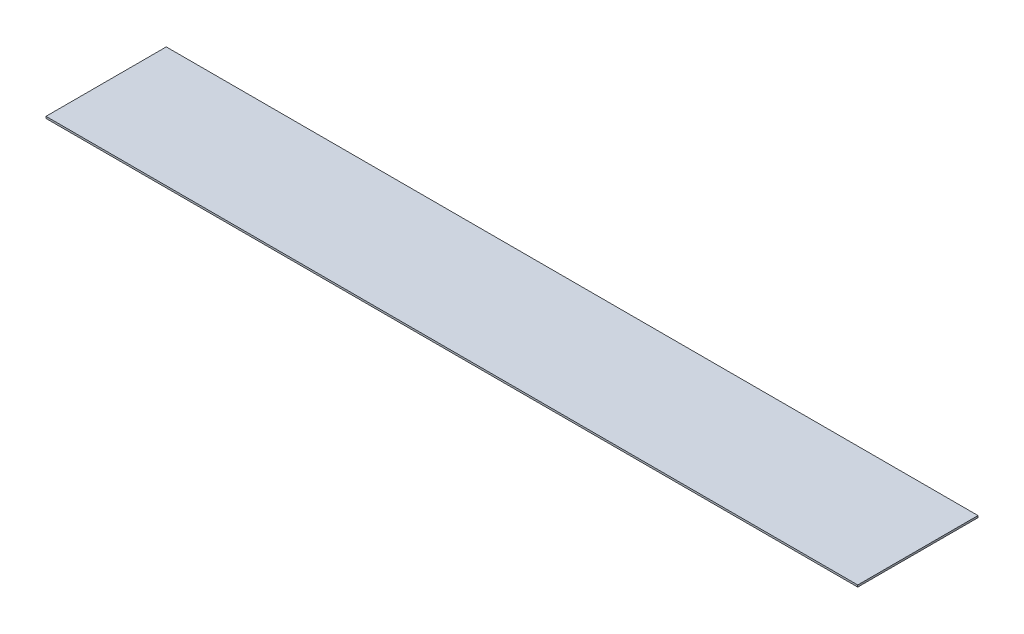
ISO-10303-21;
HEADER;
FILE_DESCRIPTION(('STEP AP214'),'2;1');
FILE_NAME('part.step','',(''),(''),'','','');
FILE_SCHEMA(('AUTOMOTIVE_DESIGN { 1 0 10303 214 1 1 1 1 }'));
ENDSEC;
DATA;
#1=APPLICATION_CONTEXT('core data for automotive mechanical design processes');
#2=APPLICATION_PROTOCOL_DEFINITION('international standard','automotive_design',2000,#1);
#3=PRODUCT_CONTEXT('',#1,'mechanical');
#4=PRODUCT('Part','Part','',(#3));
#5=PRODUCT_RELATED_PRODUCT_CATEGORY('part','',(#4));
#6=PRODUCT_DEFINITION_FORMATION('','',#4);
#7=PRODUCT_DEFINITION_CONTEXT('part definition',#1,'design');
#8=PRODUCT_DEFINITION('design','',#6,#7);
#9=PRODUCT_DEFINITION_SHAPE('','',#8);
#10=(LENGTH_UNIT() NAMED_UNIT(*) SI_UNIT(.MILLI.,.METRE.));
#11=(NAMED_UNIT(*) PLANE_ANGLE_UNIT() SI_UNIT($,.RADIAN.));
#12=(NAMED_UNIT(*) SI_UNIT($,.STERADIAN.) SOLID_ANGLE_UNIT());
#13=UNCERTAINTY_MEASURE_WITH_UNIT(LENGTH_MEASURE(1.E-05),#10,'distance_accuracy_value','');
#14=(GEOMETRIC_REPRESENTATION_CONTEXT(3) GLOBAL_UNCERTAINTY_ASSIGNED_CONTEXT((#13)) GLOBAL_UNIT_ASSIGNED_CONTEXT((#10,
#11,#12)) REPRESENTATION_CONTEXT('',''));
#15=CARTESIAN_POINT('',(0.,0.,0.));
#16=DIRECTION('',(0.,0.,1.));
#17=DIRECTION('',(1.,0.,0.));
#18=AXIS2_PLACEMENT_3D('',#15,#16,#17);
#19=CARTESIAN_POINT('',(0.,1.5875,0.));
#20=DIRECTION('',(1.,0.,0.));
#21=DIRECTION('',(0.,0.,-1.));
#22=AXIS2_PLACEMENT_3D('',#19,#20,#21);
#23=PLANE('',#22);
#24=DIRECTION('',(0.,0.,1.));
#25=VECTOR('',#24,1.);
#26=CARTESIAN_POINT('',(0.,0.,0.));
#27=LINE('',#26,#25);
#28=CARTESIAN_POINT('',(0.,0.,-101.6));
#29=VERTEX_POINT('',#28);
#30=CARTESIAN_POINT('',(0.,0.,0.));
#31=VERTEX_POINT('',#30);
#32=EDGE_CURVE('E97',#29,#31,#27,.T.);
#33=ORIENTED_EDGE('',*,*,#32,.T.);
#34=DIRECTION('',(0.,-1.,0.));
#35=VECTOR('',#34,1.);
#36=CARTESIAN_POINT('',(0.,1.5875,0.));
#37=LINE('',#36,#35);
#38=CARTESIAN_POINT('',(0.,1.5875,0.));
#39=VERTEX_POINT('',#38);
#40=EDGE_CURVE('E11',#39,#31,#37,.T.);
#41=ORIENTED_EDGE('',*,*,#40,.F.);
#42=DIRECTION('',(0.,0.,1.));
#43=VECTOR('',#42,1.);
#44=CARTESIAN_POINT('',(0.,1.5875,0.));
#45=LINE('',#44,#43);
#46=CARTESIAN_POINT('',(0.,1.5875,-101.6));
#47=VERTEX_POINT('',#46);
#48=EDGE_CURVE('E85',#47,#39,#45,.T.);
#49=ORIENTED_EDGE('',*,*,#48,.F.);
#50=DIRECTION('',(0.,-1.,0.));
#51=VECTOR('',#50,1.);
#52=CARTESIAN_POINT('',(0.,1.5875,-101.6));
#53=LINE('',#52,#51);
#54=EDGE_CURVE('E93',#47,#29,#53,.T.);
#55=ORIENTED_EDGE('',*,*,#54,.T.);
#56=EDGE_LOOP('',(#33,#41,#49,#55));
#57=FACE_BOUND('',#56,.T.);
#58=ADVANCED_FACE('F34',(#57),#23,.F.);
#59=CARTESIAN_POINT('',(0.,1.5875,0.));
#60=DIRECTION('',(0.,0.,-1.));
#61=DIRECTION('',(-1.,0.,0.));
#62=AXIS2_PLACEMENT_3D('',#59,#60,#61);
#63=PLANE('',#62);
#64=DIRECTION('',(1.,0.,0.));
#65=VECTOR('',#64,1.);
#66=CARTESIAN_POINT('',(0.,0.,0.));
#67=LINE('',#66,#65);
#68=CARTESIAN_POINT('',(685.8,0.,0.));
#69=VERTEX_POINT('',#68);
#70=EDGE_CURVE('E89',#31,#69,#67,.T.);
#71=ORIENTED_EDGE('',*,*,#70,.T.);
#72=DIRECTION('',(0.,-1.,0.));
#73=VECTOR('',#72,1.);
#74=CARTESIAN_POINT('',(685.8,1.5875,0.));
#75=LINE('',#74,#73);
#76=CARTESIAN_POINT('',(685.8,1.5875,0.));
#77=VERTEX_POINT('',#76);
#78=EDGE_CURVE('E42',#77,#69,#75,.T.);
#79=ORIENTED_EDGE('',*,*,#78,.F.);
#80=DIRECTION('',(1.,0.,0.));
#81=VECTOR('',#80,1.);
#82=CARTESIAN_POINT('',(0.,1.5875,0.));
#83=LINE('',#82,#81);
#84=EDGE_CURVE('E80',#39,#77,#83,.T.);
#85=ORIENTED_EDGE('',*,*,#84,.F.);
#86=ORIENTED_EDGE('',*,*,#40,.T.);
#87=EDGE_LOOP('',(#71,#79,#85,#86));
#88=FACE_BOUND('',#87,.T.);
#89=ADVANCED_FACE('F88',(#88),#63,.F.);
#90=CARTESIAN_POINT('',(685.8,1.5875,0.));
#91=DIRECTION('',(-1.,0.,0.));
#92=DIRECTION('',(0.,0.,1.));
#93=AXIS2_PLACEMENT_3D('',#90,#91,#92);
#94=PLANE('',#93);
#95=DIRECTION('',(0.,0.,-1.));
#96=VECTOR('',#95,1.);
#97=CARTESIAN_POINT('',(685.8,0.,0.));
#98=LINE('',#97,#96);
#99=CARTESIAN_POINT('',(685.8,0.,-101.6));
#100=VERTEX_POINT('',#99);
#101=EDGE_CURVE('E67',#69,#100,#98,.T.);
#102=ORIENTED_EDGE('',*,*,#101,.T.);
#103=DIRECTION('',(0.,-1.,0.));
#104=VECTOR('',#103,1.);
#105=CARTESIAN_POINT('',(685.8,1.5875,-101.6));
#106=LINE('',#105,#104);
#107=CARTESIAN_POINT('',(685.8,1.5875,-101.6));
#108=VERTEX_POINT('',#107);
#109=EDGE_CURVE('E90',#108,#100,#106,.T.);
#110=ORIENTED_EDGE('',*,*,#109,.F.);
#111=DIRECTION('',(0.,0.,-1.));
#112=VECTOR('',#111,1.);
#113=CARTESIAN_POINT('',(685.8,1.5875,0.));
#114=LINE('',#113,#112);
#115=EDGE_CURVE('E83',#77,#108,#114,.T.);
#116=ORIENTED_EDGE('',*,*,#115,.F.);
#117=ORIENTED_EDGE('',*,*,#78,.T.);
#118=EDGE_LOOP('',(#102,#110,#116,#117));
#119=FACE_BOUND('',#118,.T.);
#120=ADVANCED_FACE('F91',(#119),#94,.F.);
#121=CARTESIAN_POINT('',(0.,1.5875,-101.6));
#122=DIRECTION('',(0.,0.,1.));
#123=DIRECTION('',(1.,0.,0.));
#124=AXIS2_PLACEMENT_3D('',#121,#122,#123);
#125=PLANE('',#124);
#126=DIRECTION('',(-1.,0.,0.));
#127=VECTOR('',#126,1.);
#128=CARTESIAN_POINT('',(0.,0.,-101.6));
#129=LINE('',#128,#127);
#130=EDGE_CURVE('E73',#100,#29,#129,.T.);
#131=ORIENTED_EDGE('',*,*,#130,.T.);
#132=ORIENTED_EDGE('',*,*,#54,.F.);
#133=DIRECTION('',(-1.,0.,0.));
#134=VECTOR('',#133,1.);
#135=CARTESIAN_POINT('',(0.,1.5875,-101.6));
#136=LINE('',#135,#134);
#137=EDGE_CURVE('E50',#108,#47,#136,.T.);
#138=ORIENTED_EDGE('',*,*,#137,.F.);
#139=ORIENTED_EDGE('',*,*,#109,.T.);
#140=EDGE_LOOP('',(#131,#132,#138,#139));
#141=FACE_BOUND('',#140,.T.);
#142=ADVANCED_FACE('F104',(#141),#125,.F.);
#143=CARTESIAN_POINT('',(0.,1.5875,0.));
#144=DIRECTION('',(0.,-1.,0.));
#145=DIRECTION('',(0.,0.,-1.));
#146=AXIS2_PLACEMENT_3D('',#143,#144,#145);
#147=PLANE('',#146);
#148=ORIENTED_EDGE('',*,*,#48,.T.);
#149=ORIENTED_EDGE('',*,*,#84,.T.);
#150=ORIENTED_EDGE('',*,*,#115,.T.);
#151=ORIENTED_EDGE('',*,*,#137,.T.);
#152=EDGE_LOOP('',(#148,#149,#150,#151));
#153=FACE_BOUND('',#152,.T.);
#154=ADVANCED_FACE('F81',(#153),#147,.F.);
#155=CARTESIAN_POINT('',(0.,0.,0.));
#156=DIRECTION('',(0.,-1.,0.));
#157=DIRECTION('',(0.,0.,-1.));
#158=AXIS2_PLACEMENT_3D('',#155,#156,#157);
#159=PLANE('',#158);
#160=ORIENTED_EDGE('',*,*,#32,.F.);
#161=ORIENTED_EDGE('',*,*,#130,.F.);
#162=ORIENTED_EDGE('',*,*,#101,.F.);
#163=ORIENTED_EDGE('',*,*,#70,.F.);
#164=EDGE_LOOP('',(#160,#161,#162,#163));
#165=FACE_BOUND('',#164,.T.);
#166=ADVANCED_FACE('F107',(#165),#159,.T.);
#167=CLOSED_SHELL('',(#58,#89,#120,#142,#154,#166));
#168=MANIFOLD_SOLID_BREP('B2',#167);
#169=ADVANCED_BREP_SHAPE_REPRESENTATION('',(#18,#168),#14);
#170=SHAPE_DEFINITION_REPRESENTATION(#9,#169);
ENDSEC;
END-ISO-10303-21;
